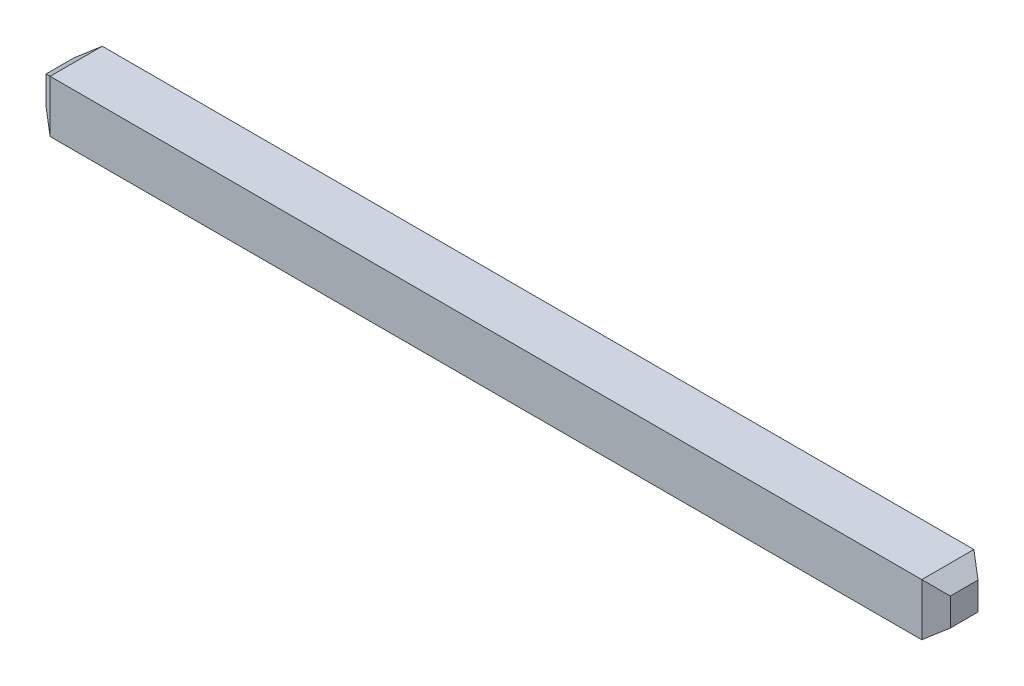
ISO-10303-21;
HEADER;
FILE_DESCRIPTION(('STEP AP214'),'2;1');
FILE_NAME('part.step','',(''),(''),'','','');
FILE_SCHEMA(('AUTOMOTIVE_DESIGN { 1 0 10303 214 1 1 1 1 }'));
ENDSEC;
DATA;
#1=APPLICATION_CONTEXT('core data for automotive mechanical design processes');
#2=APPLICATION_PROTOCOL_DEFINITION('international standard','automotive_design',2000,#1);
#3=PRODUCT_CONTEXT('',#1,'mechanical');
#4=PRODUCT('Part','Part','',(#3));
#5=PRODUCT_RELATED_PRODUCT_CATEGORY('part','',(#4));
#6=PRODUCT_DEFINITION_FORMATION('','',#4);
#7=PRODUCT_DEFINITION_CONTEXT('part definition',#1,'design');
#8=PRODUCT_DEFINITION('design','',#6,#7);
#9=PRODUCT_DEFINITION_SHAPE('','',#8);
#10=(LENGTH_UNIT() NAMED_UNIT(*) SI_UNIT(.MILLI.,.METRE.));
#11=(NAMED_UNIT(*) PLANE_ANGLE_UNIT() SI_UNIT($,.RADIAN.));
#12=(NAMED_UNIT(*) SI_UNIT($,.STERADIAN.) SOLID_ANGLE_UNIT());
#13=UNCERTAINTY_MEASURE_WITH_UNIT(LENGTH_MEASURE(1.E-05),#10,'distance_accuracy_value','');
#14=(GEOMETRIC_REPRESENTATION_CONTEXT(3) GLOBAL_UNCERTAINTY_ASSIGNED_CONTEXT((#13)) GLOBAL_UNIT_ASSIGNED_CONTEXT((#10,
#11,#12)) REPRESENTATION_CONTEXT('',''));
#15=CARTESIAN_POINT('',(0.,0.,0.));
#16=DIRECTION('',(0.,0.,1.));
#17=DIRECTION('',(1.,0.,0.));
#18=AXIS2_PLACEMENT_3D('',#15,#16,#17);
#19=CARTESIAN_POINT('',(-2.4,3.77,-16.755));
#20=DIRECTION('',(0.5999999999908,0.,0.8000000000069));
#21=DIRECTION('',(0.8000000000069,0.,-0.5999999999908));
#22=AXIS2_PLACEMENT_3D('',#19,#20,#21);
#23=PLANE('',#22);
#24=DIRECTION('',(0.,1.,0.));
#25=VECTOR('',#24,1.);
#26=CARTESIAN_POINT('',(-2.3,3.77,-16.83));
#27=LINE('',#26,#25);
#28=CARTESIAN_POINT('',(-2.29999999999957,4.09,-16.8299999999994));
#29=VERTEX_POINT('',#28);
#30=CARTESIAN_POINT('',(-2.29999999999957,3.45,-16.8299999999994));
#31=VERTEX_POINT('',#30);
#32=EDGE_CURVE('E101',#29,#31,#27,.F.);
#33=ORIENTED_EDGE('',*,*,#32,.T.);
#34=DIRECTION('',(-0.685994340570039,0.514495755427529,0.51449575542752));
#35=VECTOR('',#34,1.);
#36=CARTESIAN_POINT('',(-2.3,3.45,-16.83));
#37=LINE('',#36,#35);
#38=CARTESIAN_POINT('',(-2.50000000000022,3.6,-16.6800000000003));
#39=VERTEX_POINT('',#38);
#40=EDGE_CURVE('E85',#31,#39,#37,.T.);
#41=ORIENTED_EDGE('',*,*,#40,.T.);
#42=DIRECTION('',(0.,1.,0.));
#43=VECTOR('',#42,1.);
#44=CARTESIAN_POINT('',(-2.5,3.77,-16.68));
#45=LINE('',#44,#43);
#46=CARTESIAN_POINT('',(-2.50000000000043,3.94,-16.6800000000006));
#47=VERTEX_POINT('',#46);
#48=EDGE_CURVE('E79',#39,#47,#45,.T.);
#49=ORIENTED_EDGE('',*,*,#48,.T.);
#50=DIRECTION('',(-0.685994340570039,-0.514495755427529,0.51449575542752));
#51=VECTOR('',#50,1.);
#52=CARTESIAN_POINT('',(-2.3,4.09,-16.83));
#53=LINE('',#52,#51);
#54=EDGE_CURVE('E20',#29,#47,#53,.T.);
#55=ORIENTED_EDGE('',*,*,#54,.F.);
#56=EDGE_LOOP('',(#33,#41,#49,#55));
#57=FACE_BOUND('',#56,.T.);
#58=ADVANCED_FACE('F17',(#57),#23,.F.);
#59=CARTESIAN_POINT('',(8.5,3.77,-16.755));
#60=DIRECTION('',(-0.5999999999908,0.,0.8000000000069));
#61=DIRECTION('',(0.8000000000069,0.,0.5999999999908));
#62=AXIS2_PLACEMENT_3D('',#59,#60,#61);
#63=PLANE('',#62);
#64=DIRECTION('',(0.,1.,0.));
#65=VECTOR('',#64,1.);
#66=CARTESIAN_POINT('',(8.6,3.77,-16.68));
#67=LINE('',#66,#65);
#68=CARTESIAN_POINT('',(8.60000000000021,3.6,-16.6800000000003));
#69=VERTEX_POINT('',#68);
#70=CARTESIAN_POINT('',(8.60000000000043,3.94,-16.6800000000006));
#71=VERTEX_POINT('',#70);
#72=EDGE_CURVE('E113',#69,#71,#67,.T.);
#73=ORIENTED_EDGE('',*,*,#72,.F.);
#74=DIRECTION('',(-0.685994340570037,-0.514495755427528,-0.514495755427522));
#75=VECTOR('',#74,1.);
#76=CARTESIAN_POINT('',(8.6,3.6,-16.68));
#77=LINE('',#76,#75);
#78=CARTESIAN_POINT('',(8.39999999999957,3.45,-16.8299999999994));
#79=VERTEX_POINT('',#78);
#80=EDGE_CURVE('E108',#69,#79,#77,.T.);
#81=ORIENTED_EDGE('',*,*,#80,.T.);
#82=DIRECTION('',(0.,1.,0.));
#83=VECTOR('',#82,1.);
#84=CARTESIAN_POINT('',(8.4,3.77,-16.83));
#85=LINE('',#84,#83);
#86=CARTESIAN_POINT('',(8.39999999999957,4.09,-16.8299999999994));
#87=VERTEX_POINT('',#86);
#88=EDGE_CURVE('E99',#79,#87,#85,.T.);
#89=ORIENTED_EDGE('',*,*,#88,.T.);
#90=DIRECTION('',(-0.685994340570037,0.514495755427528,-0.514495755427522));
#91=VECTOR('',#90,1.);
#92=CARTESIAN_POINT('',(8.6,3.94,-16.68));
#93=LINE('',#92,#91);
#94=EDGE_CURVE('E116',#71,#87,#93,.T.);
#95=ORIENTED_EDGE('',*,*,#94,.F.);
#96=EDGE_LOOP('',(#73,#81,#89,#95));
#97=FACE_BOUND('',#96,.T.);
#98=ADVANCED_FACE('F214',(#97),#63,.F.);
#99=CARTESIAN_POINT('',(-2.4,4.015,-16.51));
#100=DIRECTION('',(-0.6,0.8,0.));
#101=DIRECTION('',(-0.8,-0.6,0.));
#102=AXIS2_PLACEMENT_3D('',#99,#100,#101);
#103=PLANE('',#102);
#104=DIRECTION('',(-0.685994340575992,-0.514495755427529,-0.514495755419582));
#105=VECTOR('',#104,1.);
#106=CARTESIAN_POINT('',(-2.29999999999913,4.09,-16.1900000000012));
#107=LINE('',#106,#105);
#108=CARTESIAN_POINT('',(-2.29999999999989,4.09,-16.1900000000001));
#109=VERTEX_POINT('',#108);
#110=CARTESIAN_POINT('',(-2.50000000000022,3.94,-16.3399999999997));
#111=VERTEX_POINT('',#110);
#112=EDGE_CURVE('E128',#109,#111,#107,.T.);
#113=ORIENTED_EDGE('',*,*,#112,.F.);
#114=DIRECTION('',(0.,0.,1.));
#115=VECTOR('',#114,1.);
#116=CARTESIAN_POINT('',(-2.3,4.09,-16.51));
#117=LINE('',#116,#115);
#118=EDGE_CURVE('E93',#29,#109,#117,.T.);
#119=ORIENTED_EDGE('',*,*,#118,.F.);
#120=ORIENTED_EDGE('',*,*,#54,.T.);
#121=DIRECTION('',(0.,0.,-1.));
#122=VECTOR('',#121,1.);
#123=CARTESIAN_POINT('',(-2.5,3.94,-16.51));
#124=LINE('',#123,#122);
#125=EDGE_CURVE('E87',#47,#111,#124,.F.);
#126=ORIENTED_EDGE('',*,*,#125,.T.);
#127=EDGE_LOOP('',(#113,#119,#120,#126));
#128=FACE_BOUND('',#127,.T.);
#129=ADVANCED_FACE('F90',(#128),#103,.T.);
#130=CARTESIAN_POINT('',(-2.5,3.77,-16.51));
#131=DIRECTION('',(1.,0.,0.));
#132=DIRECTION('',(0.,0.,-1.));
#133=AXIS2_PLACEMENT_3D('',#130,#131,#132);
#134=PLANE('',#133);
#135=DIRECTION('',(0.,1.,0.));
#136=VECTOR('',#135,1.);
#137=CARTESIAN_POINT('',(-2.50000000000087,3.77,-16.3399999999988));
#138=LINE('',#137,#136);
#139=CARTESIAN_POINT('',(-2.50000000000022,3.6,-16.3399999999997));
#140=VERTEX_POINT('',#139);
#141=EDGE_CURVE('E97',#111,#140,#138,.F.);
#142=ORIENTED_EDGE('',*,*,#141,.F.);
#143=ORIENTED_EDGE('',*,*,#125,.F.);
#144=ORIENTED_EDGE('',*,*,#48,.F.);
#145=DIRECTION('',(0.,0.,1.));
#146=VECTOR('',#145,1.);
#147=CARTESIAN_POINT('',(-2.5,3.6,-16.51));
#148=LINE('',#147,#146);
#149=EDGE_CURVE('E105',#39,#140,#148,.T.);
#150=ORIENTED_EDGE('',*,*,#149,.T.);
#151=EDGE_LOOP('',(#142,#143,#144,#150));
#152=FACE_BOUND('',#151,.T.);
#153=ADVANCED_FACE('F95',(#152),#134,.F.);
#154=CARTESIAN_POINT('',(3.05,3.77,-16.83));
#155=DIRECTION('',(0.,0.,1.));
#156=DIRECTION('',(1.,0.,0.));
#157=AXIS2_PLACEMENT_3D('',#154,#155,#156);
#158=PLANE('',#157);
#159=ORIENTED_EDGE('',*,*,#32,.F.);
#160=DIRECTION('',(1.,0.,0.));
#161=VECTOR('',#160,1.);
#162=CARTESIAN_POINT('',(3.05,4.09,-16.83));
#163=LINE('',#162,#161);
#164=EDGE_CURVE('E122',#87,#29,#163,.F.);
#165=ORIENTED_EDGE('',*,*,#164,.F.);
#166=ORIENTED_EDGE('',*,*,#88,.F.);
#167=DIRECTION('',(1.,0.,0.));
#168=VECTOR('',#167,1.);
#169=CARTESIAN_POINT('',(3.05,3.45,-16.83));
#170=LINE('',#169,#168);
#171=EDGE_CURVE('E136',#79,#31,#170,.F.);
#172=ORIENTED_EDGE('',*,*,#171,.T.);
#173=EDGE_LOOP('',(#159,#165,#166,#172));
#174=FACE_BOUND('',#173,.T.);
#175=ADVANCED_FACE('F182',(#174),#158,.F.);
#176=CARTESIAN_POINT('',(-2.4,3.525,-16.51));
#177=DIRECTION('',(0.6,0.8,0.));
#178=DIRECTION('',(-0.8,0.6,0.));
#179=AXIS2_PLACEMENT_3D('',#176,#177,#178);
#180=PLANE('',#179);
#181=DIRECTION('',(0.,0.,1.));
#182=VECTOR('',#181,1.);
#183=CARTESIAN_POINT('',(-2.3,3.45,-16.51));
#184=LINE('',#183,#182);
#185=CARTESIAN_POINT('',(-2.29999999999978,3.45,-16.1900000000003));
#186=VERTEX_POINT('',#185);
#187=EDGE_CURVE('E139',#31,#186,#184,.T.);
#188=ORIENTED_EDGE('',*,*,#187,.T.);
#189=DIRECTION('',(0.685994340575992,-0.514495755427529,0.514495755419582));
#190=VECTOR('',#189,1.);
#191=CARTESIAN_POINT('',(-2.50000000000087,3.6,-16.3399999999988));
#192=LINE('',#191,#190);
#193=EDGE_CURVE('E131',#140,#186,#192,.T.);
#194=ORIENTED_EDGE('',*,*,#193,.F.);
#195=ORIENTED_EDGE('',*,*,#149,.F.);
#196=ORIENTED_EDGE('',*,*,#40,.F.);
#197=EDGE_LOOP('',(#188,#194,#195,#196));
#198=FACE_BOUND('',#197,.T.);
#199=ADVANCED_FACE('F179',(#198),#180,.F.);
#200=CARTESIAN_POINT('',(8.5,3.525,-16.51));
#201=DIRECTION('',(-0.6,0.8,0.));
#202=DIRECTION('',(-0.8,-0.6,0.));
#203=AXIS2_PLACEMENT_3D('',#200,#201,#202);
#204=PLANE('',#203);
#205=DIRECTION('',(0.,0.,-1.));
#206=VECTOR('',#205,1.);
#207=CARTESIAN_POINT('',(8.6,3.6,-16.51));
#208=LINE('',#207,#206);
#209=CARTESIAN_POINT('',(8.60000000000022,3.6,-16.3399999999997));
#210=VERTEX_POINT('',#209);
#211=EDGE_CURVE('E110',#210,#69,#208,.T.);
#212=ORIENTED_EDGE('',*,*,#211,.F.);
#213=DIRECTION('',(0.685994340575992,0.514495755427534,-0.514495755419576));
#214=VECTOR('',#213,1.);
#215=CARTESIAN_POINT('',(8.39999999999913,3.45,-16.1900000000012));
#216=LINE('',#215,#214);
#217=CARTESIAN_POINT('',(8.39999999999989,3.45,-16.1900000000001));
#218=VERTEX_POINT('',#217);
#219=EDGE_CURVE('E35',#218,#210,#216,.T.);
#220=ORIENTED_EDGE('',*,*,#219,.F.);
#221=DIRECTION('',(0.,0.,1.));
#222=VECTOR('',#221,1.);
#223=CARTESIAN_POINT('',(8.4,3.45,-16.51));
#224=LINE('',#223,#222);
#225=EDGE_CURVE('E134',#218,#79,#224,.F.);
#226=ORIENTED_EDGE('',*,*,#225,.T.);
#227=ORIENTED_EDGE('',*,*,#80,.F.);
#228=EDGE_LOOP('',(#212,#220,#226,#227));
#229=FACE_BOUND('',#228,.T.);
#230=ADVANCED_FACE('F181',(#229),#204,.F.);
#231=CARTESIAN_POINT('',(8.6,3.77,-16.51));
#232=DIRECTION('',(1.,0.,0.));
#233=DIRECTION('',(0.,0.,-1.));
#234=AXIS2_PLACEMENT_3D('',#231,#232,#233);
#235=PLANE('',#234);
#236=ORIENTED_EDGE('',*,*,#72,.T.);
#237=DIRECTION('',(0.,0.,1.));
#238=VECTOR('',#237,1.);
#239=CARTESIAN_POINT('',(8.6,3.94,-16.51));
#240=LINE('',#239,#238);
#241=CARTESIAN_POINT('',(8.60000000000022,3.94,-16.3399999999997));
#242=VERTEX_POINT('',#241);
#243=EDGE_CURVE('E119',#242,#71,#240,.F.);
#244=ORIENTED_EDGE('',*,*,#243,.F.);
#245=DIRECTION('',(0.,1.,0.));
#246=VECTOR('',#245,1.);
#247=CARTESIAN_POINT('',(8.60000000000087,3.77,-16.3399999999988));
#248=LINE('',#247,#246);
#249=EDGE_CURVE('E142',#210,#242,#248,.T.);
#250=ORIENTED_EDGE('',*,*,#249,.F.);
#251=ORIENTED_EDGE('',*,*,#211,.T.);
#252=EDGE_LOOP('',(#236,#244,#250,#251));
#253=FACE_BOUND('',#252,.T.);
#254=ADVANCED_FACE('F189',(#253),#235,.T.);
#255=CARTESIAN_POINT('',(8.5,4.015,-16.51));
#256=DIRECTION('',(0.6,0.8,0.));
#257=DIRECTION('',(-0.8,0.6,0.));
#258=AXIS2_PLACEMENT_3D('',#255,#256,#257);
#259=PLANE('',#258);
#260=DIRECTION('',(-0.685994340575992,0.514495755427534,0.514495755419576));
#261=VECTOR('',#260,1.);
#262=CARTESIAN_POINT('',(8.60000000000087,3.94,-16.3399999999988));
#263=LINE('',#262,#261);
#264=CARTESIAN_POINT('',(8.39999999999989,4.09,-16.1900000000001));
#265=VERTEX_POINT('',#264);
#266=EDGE_CURVE('E145',#242,#265,#263,.T.);
#267=ORIENTED_EDGE('',*,*,#266,.F.);
#268=ORIENTED_EDGE('',*,*,#243,.T.);
#269=ORIENTED_EDGE('',*,*,#94,.T.);
#270=DIRECTION('',(0.,0.,1.));
#271=VECTOR('',#270,1.);
#272=CARTESIAN_POINT('',(8.4,4.09,-16.51));
#273=LINE('',#272,#271);
#274=EDGE_CURVE('E125',#265,#87,#273,.F.);
#275=ORIENTED_EDGE('',*,*,#274,.F.);
#276=EDGE_LOOP('',(#267,#268,#269,#275));
#277=FACE_BOUND('',#276,.T.);
#278=ADVANCED_FACE('F170',(#277),#259,.T.);
#279=CARTESIAN_POINT('',(3.05,4.09,-16.51));
#280=DIRECTION('',(0.,1.,0.));
#281=DIRECTION('',(0.,0.,1.));
#282=AXIS2_PLACEMENT_3D('',#279,#280,#281);
#283=PLANE('',#282);
#284=DIRECTION('',(1.,0.,0.));
#285=VECTOR('',#284,1.);
#286=CARTESIAN_POINT('',(3.05,4.09,-16.19));
#287=LINE('',#286,#285);
#288=EDGE_CURVE('E148',#265,#109,#287,.F.);
#289=ORIENTED_EDGE('',*,*,#288,.F.);
#290=ORIENTED_EDGE('',*,*,#274,.T.);
#291=ORIENTED_EDGE('',*,*,#164,.T.);
#292=ORIENTED_EDGE('',*,*,#118,.T.);
#293=EDGE_LOOP('',(#289,#290,#291,#292));
#294=FACE_BOUND('',#293,.T.);
#295=ADVANCED_FACE('F173',(#294),#283,.T.);
#296=CARTESIAN_POINT('',(-2.4,3.77,-16.265));
#297=DIRECTION('',(-0.599999999990736,0.,0.800000000006948));
#298=DIRECTION('',(0.800000000006948,0.,0.599999999990736));
#299=AXIS2_PLACEMENT_3D('',#296,#297,#298);
#300=PLANE('',#299);
#301=ORIENTED_EDGE('',*,*,#193,.T.);
#302=DIRECTION('',(0.,1.,0.));
#303=VECTOR('',#302,1.);
#304=CARTESIAN_POINT('',(-2.3,3.77,-16.19));
#305=LINE('',#304,#303);
#306=EDGE_CURVE('E151',#109,#186,#305,.F.);
#307=ORIENTED_EDGE('',*,*,#306,.F.);
#308=ORIENTED_EDGE('',*,*,#112,.T.);
#309=ORIENTED_EDGE('',*,*,#141,.T.);
#310=EDGE_LOOP('',(#301,#307,#308,#309));
#311=FACE_BOUND('',#310,.T.);
#312=ADVANCED_FACE('F176',(#311),#300,.T.);
#313=CARTESIAN_POINT('',(3.05,3.45,-16.51));
#314=DIRECTION('',(0.,1.,0.));
#315=DIRECTION('',(0.,0.,1.));
#316=AXIS2_PLACEMENT_3D('',#313,#314,#315);
#317=PLANE('',#316);
#318=ORIENTED_EDGE('',*,*,#187,.F.);
#319=ORIENTED_EDGE('',*,*,#171,.F.);
#320=ORIENTED_EDGE('',*,*,#225,.F.);
#321=DIRECTION('',(1.,0.,0.));
#322=VECTOR('',#321,1.);
#323=CARTESIAN_POINT('',(3.05,3.45,-16.19));
#324=LINE('',#323,#322);
#325=EDGE_CURVE('E26',#186,#218,#324,.T.);
#326=ORIENTED_EDGE('',*,*,#325,.F.);
#327=EDGE_LOOP('',(#318,#319,#320,#326));
#328=FACE_BOUND('',#327,.T.);
#329=ADVANCED_FACE('F162',(#328),#317,.F.);
#330=CARTESIAN_POINT('',(8.5,3.77,-16.265));
#331=DIRECTION('',(0.599999999990736,0.,0.800000000006948));
#332=DIRECTION('',(0.800000000006948,0.,-0.599999999990736));
#333=AXIS2_PLACEMENT_3D('',#330,#331,#332);
#334=PLANE('',#333);
#335=ORIENTED_EDGE('',*,*,#266,.T.);
#336=DIRECTION('',(0.,1.,0.));
#337=VECTOR('',#336,1.);
#338=CARTESIAN_POINT('',(8.4,3.77,-16.19));
#339=LINE('',#338,#337);
#340=EDGE_CURVE('E11',#218,#265,#339,.T.);
#341=ORIENTED_EDGE('',*,*,#340,.F.);
#342=ORIENTED_EDGE('',*,*,#219,.T.);
#343=ORIENTED_EDGE('',*,*,#249,.T.);
#344=EDGE_LOOP('',(#335,#341,#342,#343));
#345=FACE_BOUND('',#344,.T.);
#346=ADVANCED_FACE('F166',(#345),#334,.T.);
#347=CARTESIAN_POINT('',(3.05,3.77,-16.19));
#348=DIRECTION('',(0.,0.,1.));
#349=DIRECTION('',(1.,0.,0.));
#350=AXIS2_PLACEMENT_3D('',#347,#348,#349);
#351=PLANE('',#350);
#352=ORIENTED_EDGE('',*,*,#325,.T.);
#353=ORIENTED_EDGE('',*,*,#340,.T.);
#354=ORIENTED_EDGE('',*,*,#288,.T.);
#355=ORIENTED_EDGE('',*,*,#306,.T.);
#356=EDGE_LOOP('',(#352,#353,#354,#355));
#357=FACE_BOUND('',#356,.T.);
#358=ADVANCED_FACE('F157',(#357),#351,.T.);
#359=CLOSED_SHELL('',(#58,#98,#129,#153,#175,#199,#230,#254,#278,#295,#312,#329,#346,#358));
#360=MANIFOLD_SOLID_BREP('B1',#359);
#361=ADVANCED_BREP_SHAPE_REPRESENTATION('',(#18,#360),#14);
#362=SHAPE_DEFINITION_REPRESENTATION(#9,#361);
ENDSEC;
END-ISO-10303-21;
